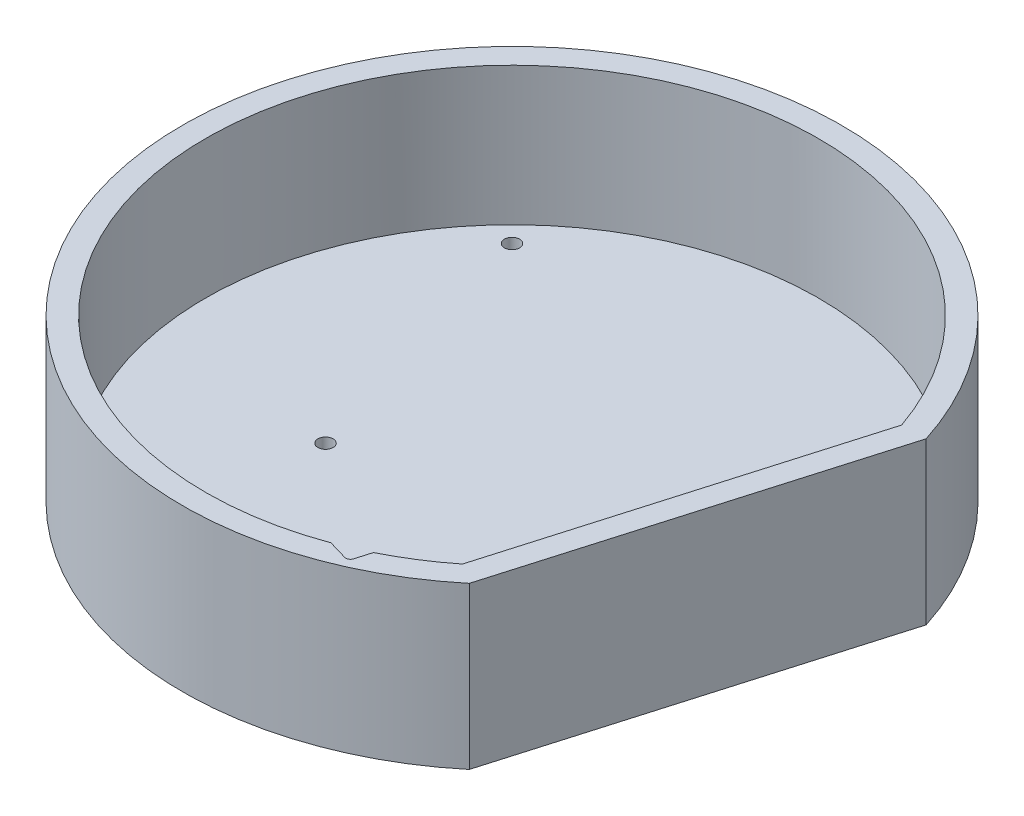
ISO-10303-21;
HEADER;
FILE_DESCRIPTION(('STEP AP214'),'2;1');
FILE_NAME('part.step','',(''),(''),'','','');
FILE_SCHEMA(('AUTOMOTIVE_DESIGN { 1 0 10303 214 1 1 1 1 }'));
ENDSEC;
DATA;
#1=APPLICATION_CONTEXT('core data for automotive mechanical design processes');
#2=APPLICATION_PROTOCOL_DEFINITION('international standard','automotive_design',2000,#1);
#3=PRODUCT_CONTEXT('',#1,'mechanical');
#4=PRODUCT('Part','Part','',(#3));
#5=PRODUCT_RELATED_PRODUCT_CATEGORY('part','',(#4));
#6=PRODUCT_DEFINITION_FORMATION('','',#4);
#7=PRODUCT_DEFINITION_CONTEXT('part definition',#1,'design');
#8=PRODUCT_DEFINITION('design','',#6,#7);
#9=PRODUCT_DEFINITION_SHAPE('','',#8);
#10=(LENGTH_UNIT() NAMED_UNIT(*) SI_UNIT(.MILLI.,.METRE.));
#11=(NAMED_UNIT(*) PLANE_ANGLE_UNIT() SI_UNIT($,.RADIAN.));
#12=(NAMED_UNIT(*) SI_UNIT($,.STERADIAN.) SOLID_ANGLE_UNIT());
#13=UNCERTAINTY_MEASURE_WITH_UNIT(LENGTH_MEASURE(1.E-05),#10,'distance_accuracy_value','');
#14=(GEOMETRIC_REPRESENTATION_CONTEXT(3) GLOBAL_UNCERTAINTY_ASSIGNED_CONTEXT((#13)) GLOBAL_UNIT_ASSIGNED_CONTEXT((#10,
#11,#12)) REPRESENTATION_CONTEXT('',''));
#15=CARTESIAN_POINT('',(0.,0.,0.));
#16=DIRECTION('',(0.,0.,1.));
#17=DIRECTION('',(1.,0.,0.));
#18=AXIS2_PLACEMENT_3D('',#15,#16,#17);
#19=CARTESIAN_POINT('',(0.,5.,0.));
#20=DIRECTION('',(0.,1.,0.));
#21=DIRECTION('',(0.,0.,1.));
#22=AXIS2_PLACEMENT_3D('',#19,#20,#21);
#23=PLANE('',#22);
#24=CARTESIAN_POINT('',(26.5691382315799,5.,29.6733976692491));
#25=DIRECTION('',(0.,1.,0.));
#26=DIRECTION('',(0.,0.,1.));
#27=AXIS2_PLACEMENT_3D('',#24,#25,#26);
#28=CIRCLE('',#27,1.65);
#29=CARTESIAN_POINT('',(26.5691382315799,5.,31.3233976692491));
#30=VERTEX_POINT('',#29);
#31=EDGE_CURVE('E261',#30,#30,#28,.T.);
#32=ORIENTED_EDGE('',*,*,#31,.F.);
#33=EDGE_LOOP('',(#32));
#34=FACE_BOUND('',#33,.T.);
#35=CARTESIAN_POINT('',(-26.2282282114271,5.,14.264371201531));
#36=DIRECTION('',(0.,1.,0.));
#37=DIRECTION('',(0.,0.,1.));
#38=AXIS2_PLACEMENT_3D('',#35,#36,#37);
#39=CIRCLE('',#38,1.65);
#40=CARTESIAN_POINT('',(-26.2282282114271,5.,15.914371201531));
#41=VERTEX_POINT('',#40);
#42=EDGE_CURVE('E265',#41,#41,#39,.T.);
#43=ORIENTED_EDGE('',*,*,#42,.F.);
#44=EDGE_LOOP('',(#43));
#45=FACE_BOUND('',#44,.T.);
#46=CARTESIAN_POINT('',(-43.5224223820315,5.,-43.5224223820325));
#47=DIRECTION('',(0.,1.,0.));
#48=DIRECTION('',(0.,0.,1.));
#49=AXIS2_PLACEMENT_3D('',#46,#47,#48);
#50=CIRCLE('',#49,1.65);
#51=CARTESIAN_POINT('',(-43.5224223820315,5.,-41.8724223820325));
#52=VERTEX_POINT('',#51);
#53=EDGE_CURVE('E177',#52,#52,#50,.T.);
#54=ORIENTED_EDGE('',*,*,#53,.F.);
#55=EDGE_LOOP('',(#54));
#56=FACE_BOUND('',#55,.T.);
#57=CARTESIAN_POINT('',(-43.5224223820323,5.,43.5224223820317));
#58=DIRECTION('',(0.,1.,0.));
#59=DIRECTION('',(0.,0.,1.));
#60=AXIS2_PLACEMENT_3D('',#57,#58,#59);
#61=CIRCLE('',#60,1.65);
#62=CARTESIAN_POINT('',(-43.5224223820323,5.,45.1724223820317));
#63=VERTEX_POINT('',#62);
#64=EDGE_CURVE('E171',#63,#63,#61,.T.);
#65=ORIENTED_EDGE('',*,*,#64,.F.);
#66=EDGE_LOOP('',(#65));
#67=FACE_BOUND('',#66,.T.);
#68=CARTESIAN_POINT('',(3.22127810675323,5.,61.465647864144));
#69=DIRECTION('',(0.,1.,0.));
#70=DIRECTION('',(0.,0.,1.));
#71=AXIS2_PLACEMENT_3D('',#68,#69,#70);
#72=CIRCLE('',#71,1.65);
#73=CARTESIAN_POINT('',(3.22127810675323,5.,63.115647864144));
#74=VERTEX_POINT('',#73);
#75=EDGE_CURVE('E165',#74,#74,#72,.T.);
#76=ORIENTED_EDGE('',*,*,#75,.F.);
#77=EDGE_LOOP('',(#76));
#78=FACE_BOUND('',#77,.T.);
#79=CARTESIAN_POINT('',(43.522422382032,5.,-43.522422382032));
#80=DIRECTION('',(0.,1.,0.));
#81=DIRECTION('',(0.,0.,1.));
#82=AXIS2_PLACEMENT_3D('',#79,#80,#81);
#83=CIRCLE('',#82,1.65);
#84=CARTESIAN_POINT('',(43.522422382032,5.,-41.872422382032));
#85=VERTEX_POINT('',#84);
#86=EDGE_CURVE('E162',#85,#85,#83,.T.);
#87=ORIENTED_EDGE('',*,*,#86,.F.);
#88=EDGE_LOOP('',(#87));
#89=FACE_BOUND('',#88,.T.);
#90=DIRECTION('',(0.280164117594875,0.,-0.959952117145582));
#91=VECTOR('',#90,1.);
#92=CARTESIAN_POINT('',(41.3733009869135,5.,52.1199289182772));
#93=LINE('',#92,#91);
#94=CARTESIAN_POINT('',(41.3733009869135,5.,52.1199289182772));
#95=VERTEX_POINT('',#94);
#96=CARTESIAN_POINT('',(62.9130589601029,5.,-21.6837274766729));
#97=VERTEX_POINT('',#96);
#98=EDGE_CURVE('E140',#95,#97,#93,.T.);
#99=ORIENTED_EDGE('',*,*,#98,.T.);
#100=CARTESIAN_POINT('',(0.,5.,0.));
#101=DIRECTION('',(0.,1.,0.));
#102=DIRECTION('',(0.,0.,1.));
#103=AXIS2_PLACEMENT_3D('',#100,#101,#102);
#104=CIRCLE('',#103,66.545);
#105=EDGE_CURVE('E118',#97,#95,#104,.T.);
#106=ORIENTED_EDGE('',*,*,#105,.T.);
#107=EDGE_LOOP('',(#99,#106));
#108=FACE_BOUND('',#107,.T.);
#109=ADVANCED_FACE('F39',(#34,#45,#56,#67,#78,#89,#108),#23,.T.);
#110=CARTESIAN_POINT('',(0.,5.,0.));
#111=DIRECTION('',(0.,-1.,0.));
#112=DIRECTION('',(0.,0.,-1.));
#113=AXIS2_PLACEMENT_3D('',#110,#111,#112);
#114=CYLINDRICAL_SURFACE('',#113,71.545);
#115=CARTESIAN_POINT('',(0.,0.,0.));
#116=DIRECTION('',(0.,1.,0.));
#117=DIRECTION('',(0.,0.,1.));
#118=AXIS2_PLACEMENT_3D('',#115,#116,#117);
#119=CIRCLE('',#118,71.545);
#120=CARTESIAN_POINT('',(68.1495052630311,0.,-21.7791633770468));
#121=VERTEX_POINT('',#120);
#122=CARTESIAN_POINT('',(45.7363758554411,0.,55.0170059945998));
#123=VERTEX_POINT('',#122);
#124=EDGE_CURVE('E161',#121,#123,#119,.T.);
#125=ORIENTED_EDGE('',*,*,#124,.T.);
#126=DIRECTION('',(0.,-1.,0.));
#127=VECTOR('',#126,1.);
#128=CARTESIAN_POINT('',(45.7363758554411,5.,55.0170059945998));
#129=LINE('',#128,#127);
#130=CARTESIAN_POINT('',(45.7363758554411,35.,55.0170059945998));
#131=VERTEX_POINT('',#130);
#132=EDGE_CURVE('E129',#131,#123,#129,.T.);
#133=ORIENTED_EDGE('',*,*,#132,.F.);
#134=CARTESIAN_POINT('',(0.,35.,0.));
#135=DIRECTION('',(0.,1.,0.));
#136=DIRECTION('',(0.,0.,1.));
#137=AXIS2_PLACEMENT_3D('',#134,#135,#136);
#138=CIRCLE('',#137,71.545);
#139=CARTESIAN_POINT('',(68.1495052630311,35.,-21.7791633770468));
#140=VERTEX_POINT('',#139);
#141=EDGE_CURVE('E151',#140,#131,#138,.T.);
#142=ORIENTED_EDGE('',*,*,#141,.F.);
#143=DIRECTION('',(0.,-1.,0.));
#144=VECTOR('',#143,1.);
#145=CARTESIAN_POINT('',(68.1495052630311,5.,-21.7791633770468));
#146=LINE('',#145,#144);
#147=EDGE_CURVE('E186',#140,#121,#146,.T.);
#148=ORIENTED_EDGE('',*,*,#147,.T.);
#149=EDGE_LOOP('',(#125,#133,#142,#148));
#150=FACE_BOUND('',#149,.T.);
#151=ADVANCED_FACE('F218',(#150),#114,.T.);
#152=CARTESIAN_POINT('',(45.7363758554411,5.,55.0170059945998));
#153=DIRECTION('',(-0.959952117145582,0.,-0.280164117594875));
#154=DIRECTION('',(-0.280164117594875,0.,0.959952117145582));
#155=AXIS2_PLACEMENT_3D('',#152,#153,#154);
#156=PLANE('',#155);
#157=DIRECTION('',(0.280164117594875,0.,-0.959952117145582));
#158=VECTOR('',#157,1.);
#159=CARTESIAN_POINT('',(45.7363758554411,0.,55.0170059945998));
#160=LINE('',#159,#158);
#161=EDGE_CURVE('E184',#123,#121,#160,.T.);
#162=ORIENTED_EDGE('',*,*,#161,.T.);
#163=ORIENTED_EDGE('',*,*,#147,.F.);
#164=DIRECTION('',(0.280164117594875,0.,-0.959952117145582));
#165=VECTOR('',#164,1.);
#166=CARTESIAN_POINT('',(45.7363758554411,35.,55.0170059945998));
#167=LINE('',#166,#165);
#168=EDGE_CURVE('E154',#131,#140,#167,.T.);
#169=ORIENTED_EDGE('',*,*,#168,.F.);
#170=ORIENTED_EDGE('',*,*,#132,.T.);
#171=EDGE_LOOP('',(#162,#163,#169,#170));
#172=FACE_BOUND('',#171,.T.);
#173=ADVANCED_FACE('F226',(#172),#156,.F.);
#174=CARTESIAN_POINT('',(0.,0.,0.));
#175=DIRECTION('',(0.,1.,0.));
#176=DIRECTION('',(0.,0.,1.));
#177=AXIS2_PLACEMENT_3D('',#174,#175,#176);
#178=PLANE('',#177);
#179=CARTESIAN_POINT('',(26.5691382315799,0.,29.6733976692491));
#180=DIRECTION('',(0.,1.,0.));
#181=DIRECTION('',(0.,0.,1.));
#182=AXIS2_PLACEMENT_3D('',#179,#180,#181);
#183=CIRCLE('',#182,1.65);
#184=CARTESIAN_POINT('',(26.5691382315799,0.,31.3233976692491));
#185=VERTEX_POINT('',#184);
#186=EDGE_CURVE('E259',#185,#185,#183,.T.);
#187=ORIENTED_EDGE('',*,*,#186,.T.);
#188=EDGE_LOOP('',(#187));
#189=FACE_BOUND('',#188,.T.);
#190=CARTESIAN_POINT('',(-26.2282282114271,0.,14.264371201531));
#191=DIRECTION('',(0.,1.,0.));
#192=DIRECTION('',(0.,0.,1.));
#193=AXIS2_PLACEMENT_3D('',#190,#191,#192);
#194=CIRCLE('',#193,1.65);
#195=CARTESIAN_POINT('',(-26.2282282114271,0.,15.914371201531));
#196=VERTEX_POINT('',#195);
#197=EDGE_CURVE('E270',#196,#196,#194,.T.);
#198=ORIENTED_EDGE('',*,*,#197,.T.);
#199=EDGE_LOOP('',(#198));
#200=FACE_BOUND('',#199,.T.);
#201=CARTESIAN_POINT('',(43.522422382032,0.,-43.522422382032));
#202=DIRECTION('',(0.,1.,0.));
#203=DIRECTION('',(0.,0.,1.));
#204=AXIS2_PLACEMENT_3D('',#201,#202,#203);
#205=CIRCLE('',#204,1.65);
#206=CARTESIAN_POINT('',(43.522422382032,0.,-41.872422382032));
#207=VERTEX_POINT('',#206);
#208=EDGE_CURVE('E158',#207,#207,#205,.T.);
#209=ORIENTED_EDGE('',*,*,#208,.T.);
#210=EDGE_LOOP('',(#209));
#211=FACE_BOUND('',#210,.T.);
#212=CARTESIAN_POINT('',(3.22127810675323,0.,61.465647864144));
#213=DIRECTION('',(0.,1.,0.));
#214=DIRECTION('',(0.,0.,1.));
#215=AXIS2_PLACEMENT_3D('',#212,#213,#214);
#216=CIRCLE('',#215,1.65);
#217=CARTESIAN_POINT('',(3.22127810675323,0.,63.115647864144));
#218=VERTEX_POINT('',#217);
#219=EDGE_CURVE('E168',#218,#218,#216,.T.);
#220=ORIENTED_EDGE('',*,*,#219,.T.);
#221=EDGE_LOOP('',(#220));
#222=FACE_BOUND('',#221,.T.);
#223=CARTESIAN_POINT('',(-43.5224223820323,0.,43.5224223820317));
#224=DIRECTION('',(0.,1.,0.));
#225=DIRECTION('',(0.,0.,1.));
#226=AXIS2_PLACEMENT_3D('',#223,#224,#225);
#227=CIRCLE('',#226,1.65);
#228=CARTESIAN_POINT('',(-43.5224223820323,0.,45.1724223820317));
#229=VERTEX_POINT('',#228);
#230=EDGE_CURVE('E174',#229,#229,#227,.T.);
#231=ORIENTED_EDGE('',*,*,#230,.T.);
#232=EDGE_LOOP('',(#231));
#233=FACE_BOUND('',#232,.T.);
#234=CARTESIAN_POINT('',(-43.5224223820315,0.,-43.5224223820325));
#235=DIRECTION('',(0.,1.,0.));
#236=DIRECTION('',(0.,0.,1.));
#237=AXIS2_PLACEMENT_3D('',#234,#235,#236);
#238=CIRCLE('',#237,1.65);
#239=CARTESIAN_POINT('',(-43.5224223820315,0.,-41.8724223820325));
#240=VERTEX_POINT('',#239);
#241=EDGE_CURVE('E157',#240,#240,#238,.T.);
#242=ORIENTED_EDGE('',*,*,#241,.T.);
#243=EDGE_LOOP('',(#242));
#244=FACE_BOUND('',#243,.T.);
#245=ORIENTED_EDGE('',*,*,#124,.F.);
#246=ORIENTED_EDGE('',*,*,#161,.F.);
#247=EDGE_LOOP('',(#245,#246));
#248=FACE_BOUND('',#247,.T.);
#249=ADVANCED_FACE('F235',(#189,#200,#211,#222,#233,#244,#248),#178,.F.);
#250=CARTESIAN_POINT('',(-43.5224223820315,0.,-43.5224223820325));
#251=DIRECTION('',(0.,1.,0.));
#252=DIRECTION('',(0.,0.,1.));
#253=AXIS2_PLACEMENT_3D('',#250,#251,#252);
#254=CYLINDRICAL_SURFACE('',#253,1.65);
#255=ORIENTED_EDGE('',*,*,#241,.F.);
#256=EDGE_LOOP('',(#255));
#257=FACE_BOUND('',#256,.T.);
#258=ORIENTED_EDGE('',*,*,#53,.T.);
#259=EDGE_LOOP('',(#258));
#260=FACE_BOUND('',#259,.T.);
#261=ADVANCED_FACE('F233',(#257,#260),#254,.F.);
#262=CARTESIAN_POINT('',(-43.5224223820323,0.,43.5224223820317));
#263=DIRECTION('',(0.,1.,0.));
#264=DIRECTION('',(0.,0.,1.));
#265=AXIS2_PLACEMENT_3D('',#262,#263,#264);
#266=CYLINDRICAL_SURFACE('',#265,1.65);
#267=ORIENTED_EDGE('',*,*,#230,.F.);
#268=EDGE_LOOP('',(#267));
#269=FACE_BOUND('',#268,.T.);
#270=ORIENTED_EDGE('',*,*,#64,.T.);
#271=EDGE_LOOP('',(#270));
#272=FACE_BOUND('',#271,.T.);
#273=ADVANCED_FACE('F332',(#269,#272),#266,.F.);
#274=CARTESIAN_POINT('',(3.22127810675323,0.,61.465647864144));
#275=DIRECTION('',(0.,1.,0.));
#276=DIRECTION('',(0.,0.,1.));
#277=AXIS2_PLACEMENT_3D('',#274,#275,#276);
#278=CYLINDRICAL_SURFACE('',#277,1.65);
#279=ORIENTED_EDGE('',*,*,#219,.F.);
#280=EDGE_LOOP('',(#279));
#281=FACE_BOUND('',#280,.T.);
#282=ORIENTED_EDGE('',*,*,#75,.T.);
#283=EDGE_LOOP('',(#282));
#284=FACE_BOUND('',#283,.T.);
#285=ADVANCED_FACE('F341',(#281,#284),#278,.F.);
#286=CARTESIAN_POINT('',(43.522422382032,0.,-43.522422382032));
#287=DIRECTION('',(0.,1.,0.));
#288=DIRECTION('',(0.,0.,1.));
#289=AXIS2_PLACEMENT_3D('',#286,#287,#288);
#290=CYLINDRICAL_SURFACE('',#289,1.65);
#291=ORIENTED_EDGE('',*,*,#208,.F.);
#292=EDGE_LOOP('',(#291));
#293=FACE_BOUND('',#292,.T.);
#294=ORIENTED_EDGE('',*,*,#86,.T.);
#295=EDGE_LOOP('',(#294));
#296=FACE_BOUND('',#295,.T.);
#297=ADVANCED_FACE('F350',(#293,#296),#290,.F.);
#298=CARTESIAN_POINT('',(0.,35.,0.));
#299=DIRECTION('',(0.,1.,0.));
#300=DIRECTION('',(0.,0.,1.));
#301=AXIS2_PLACEMENT_3D('',#298,#299,#300);
#302=PLANE('',#301);
#303=DIRECTION('',(0.280164117594875,0.,-0.959952117145582));
#304=VECTOR('',#303,1.);
#305=CARTESIAN_POINT('',(28.2912821393938,35.,63.9276925877083));
#306=LINE('',#305,#304);
#307=CARTESIAN_POINT('',(28.5714462569886,35.,62.9677404705627));
#308=VERTEX_POINT('',#307);
#309=CARTESIAN_POINT('',(29.5468341277726,35.,59.6256791829317));
#310=VERTEX_POINT('',#309);
#311=EDGE_CURVE('E255',#308,#310,#306,.T.);
#312=ORIENTED_EDGE('',*,*,#311,.F.);
#313=CARTESIAN_POINT('',(27.6114941398431,35.,62.6875763529678));
#314=DIRECTION('',(0.,1.,0.));
#315=DIRECTION('',(0.,0.,1.));
#316=AXIS2_PLACEMENT_3D('',#313,#314,#315);
#317=CIRCLE('',#316,1.);
#318=CARTESIAN_POINT('',(27.3313300222482,35.,63.6475284701134));
#319=VERTEX_POINT('',#318);
#320=EDGE_CURVE('E11',#308,#319,#317,.F.);
#321=ORIENTED_EDGE('',*,*,#320,.T.);
#322=DIRECTION('',(-0.959952117145582,0.,-0.280164117594875));
#323=VECTOR('',#322,1.);
#324=CARTESIAN_POINT('',(-14.9723407505178,35.,51.3011099546588));
#325=LINE('',#324,#323);
#326=CARTESIAN_POINT('',(23.0914512240824,35.,62.4101106020958));
#327=VERTEX_POINT('',#326);
#328=EDGE_CURVE('E108',#319,#327,#325,.T.);
#329=ORIENTED_EDGE('',*,*,#328,.T.);
#330=CARTESIAN_POINT('',(0.,35.,0.));
#331=DIRECTION('',(0.,1.,0.));
#332=DIRECTION('',(0.,0.,1.));
#333=AXIS2_PLACEMENT_3D('',#330,#331,#332);
#334=CIRCLE('',#333,66.545);
#335=CARTESIAN_POINT('',(62.9130589601029,35.,-21.6837274766729));
#336=VERTEX_POINT('',#335);
#337=EDGE_CURVE('E114',#336,#327,#334,.T.);
#338=ORIENTED_EDGE('',*,*,#337,.F.);
#339=DIRECTION('',(0.280164117594875,0.,-0.959952117145582));
#340=VECTOR('',#339,1.);
#341=CARTESIAN_POINT('',(41.3733009869135,35.,52.1199289182772));
#342=LINE('',#341,#340);
#343=CARTESIAN_POINT('',(41.3733009869135,35.,52.1199289182772));
#344=VERTEX_POINT('',#343);
#345=EDGE_CURVE('E136',#344,#336,#342,.T.);
#346=ORIENTED_EDGE('',*,*,#345,.F.);
#347=EDGE_CURVE('E137',#310,#344,#334,.T.);
#348=ORIENTED_EDGE('',*,*,#347,.F.);
#349=EDGE_LOOP('',(#312,#321,#329,#338,#346,#348));
#350=FACE_BOUND('',#349,.T.);
#351=ORIENTED_EDGE('',*,*,#141,.T.);
#352=ORIENTED_EDGE('',*,*,#168,.T.);
#353=EDGE_LOOP('',(#351,#352));
#354=FACE_BOUND('',#353,.T.);
#355=ADVANCED_FACE('F110',(#350,#354),#302,.T.);
#356=CARTESIAN_POINT('',(0.,35.,0.));
#357=DIRECTION('',(0.,-1.,0.));
#358=DIRECTION('',(0.,0.,-1.));
#359=AXIS2_PLACEMENT_3D('',#356,#357,#358);
#360=CYLINDRICAL_SURFACE('',#359,66.545);
#361=DIRECTION('',(0.,-1.,0.));
#362=VECTOR('',#361,1.);
#363=CARTESIAN_POINT('',(29.5468341277726,35.,59.6256791829317));
#364=LINE('',#363,#362);
#365=CARTESIAN_POINT('',(29.5468341277726,19.,59.6256791829317));
#366=VERTEX_POINT('',#365);
#367=EDGE_CURVE('E198',#310,#366,#364,.T.);
#368=ORIENTED_EDGE('',*,*,#367,.F.);
#369=ORIENTED_EDGE('',*,*,#347,.T.);
#370=DIRECTION('',(0.,-1.,0.));
#371=VECTOR('',#370,1.);
#372=CARTESIAN_POINT('',(41.3733009869135,35.,52.1199289182772));
#373=LINE('',#372,#371);
#374=EDGE_CURVE('E148',#344,#95,#373,.T.);
#375=ORIENTED_EDGE('',*,*,#374,.T.);
#376=ORIENTED_EDGE('',*,*,#105,.F.);
#377=DIRECTION('',(0.,-1.,0.));
#378=VECTOR('',#377,1.);
#379=CARTESIAN_POINT('',(62.9130589601029,35.,-21.6837274766729));
#380=LINE('',#379,#378);
#381=EDGE_CURVE('E135',#336,#97,#380,.T.);
#382=ORIENTED_EDGE('',*,*,#381,.F.);
#383=ORIENTED_EDGE('',*,*,#337,.T.);
#384=DIRECTION('',(0.,-1.,0.));
#385=VECTOR('',#384,1.);
#386=CARTESIAN_POINT('',(23.0914512240824,35.,62.4101106020958));
#387=LINE('',#386,#385);
#388=CARTESIAN_POINT('',(23.0914512240824,17.3949989514268,62.4101106020958));
#389=VERTEX_POINT('',#388);
#390=EDGE_CURVE('E123',#327,#389,#387,.T.);
#391=ORIENTED_EDGE('',*,*,#390,.T.);
#392=CARTESIAN_POINT('',(23.0914512240824,17.3949989514268,62.4101106020958));
#393=CARTESIAN_POINT('',(23.0914688030825,17.3525429388355,62.410103874751));
#394=CARTESIAN_POINT('',(23.0932027413458,17.3101229819456,62.4094625752827));
#395=CARTESIAN_POINT('',(23.0998490199431,17.2256010583835,62.4070029610719));
#396=CARTESIAN_POINT('',(23.1047585861938,17.1834988465875,62.405185673618));
#397=CARTESIAN_POINT('',(23.1238336684952,17.0581958554614,62.3981212115181));
#398=CARTESIAN_POINT('',(23.142348997143,16.9757223736181,62.3912601922225));
#399=CARTESIAN_POINT('',(23.192255754793,16.8056414495918,62.3727270370539));
#400=CARTESIAN_POINT('',(23.2248125771744,16.7184283969405,62.3606188012845));
#401=CARTESIAN_POINT('',(23.3013816682862,16.549826162319,62.3320487819596));
#402=CARTESIAN_POINT('',(23.3454100392659,16.4684453732981,62.31558087835));
#403=CARTESIAN_POINT('',(23.4513874179626,16.3011558453538,62.2757828364161));
#404=CARTESIAN_POINT('',(23.515053449382,16.2164865605364,62.2517858825182));
#405=CARTESIAN_POINT('',(23.6543546248918,16.0593320907574,62.1989876864473));
#406=CARTESIAN_POINT('',(23.7299940585999,15.9868512917362,62.1701847222617));
#407=CARTESIAN_POINT('',(23.8936428365759,15.8542351523288,62.1074774503329));
#408=CARTESIAN_POINT('',(23.9819518595129,15.7945283241394,62.0734474642171));
#409=CARTESIAN_POINT('',(24.1666445866116,15.6924216503749,62.0017747215886));
#410=CARTESIAN_POINT('',(24.2630154349581,15.6499948601743,61.964137703589));
#411=CARTESIAN_POINT('',(24.4061821896428,15.6024249982529,61.9078151524176));
#412=CARTESIAN_POINT('',(24.450945558819,15.5896345395761,61.8901498033481));
#413=CARTESIAN_POINT('',(24.5411905294607,15.5680210002681,61.8544205886825));
#414=CARTESIAN_POINT('',(24.5866710926989,15.5591926478189,61.8363572863816));
#415=CARTESIAN_POINT('',(24.6324208811549,15.5523977293929,61.8181273295596));
#416=B_SPLINE_CURVE_WITH_KNOTS('',3,(#392,#393,#394,#395,#396,#397,#398,#399,#400,#401,#402,
#403,#404,#405,#406,#407,#408,#409,#410,#411,#412,#413,#414,#415),.UNSPECIFIED.,.F.,.F.,(4,2,2,
2,2,2,2,2,2,2,2,4),(0.,0.127270515160103,0.254430002502292,0.507928602625905,0.788541106541654,
1.06954963946453,1.39392547435498,1.71841778497217,2.05250691094153,2.38607308140368,
2.53531529433342,2.6843583385834),.UNSPECIFIED.);
#417=CARTESIAN_POINT('',(24.6324208811549,15.5523977293928,61.8181273295596));
#418=VERTEX_POINT('',#417);
#419=EDGE_CURVE('E48',#389,#418,#416,.T.);
#420=ORIENTED_EDGE('',*,*,#419,.T.);
#421=CARTESIAN_POINT('',(29.5468341277725,19.,59.6256791829317));
#422=CARTESIAN_POINT('',(29.5468580963109,18.9192083567755,59.6256658259351));
#423=CARTESIAN_POINT('',(29.543428119815,18.8384315504481,59.6273669609418));
#424=CARTESIAN_POINT('',(29.529845024836,18.6776430925106,59.6340958005609));
#425=CARTESIAN_POINT('',(29.5196968920723,18.5976309180832,59.6391210382676));
#426=CARTESIAN_POINT('',(29.4929702288368,18.4396268392226,59.652342275389));
#427=CARTESIAN_POINT('',(29.4764443592543,18.3616238302247,59.6605123068786));
#428=CARTESIAN_POINT('',(29.4372933384313,18.2075567557179,59.6798396722614));
#429=CARTESIAN_POINT('',(29.4146673592039,18.131492954959,59.6909974116841));
#430=CARTESIAN_POINT('',(29.3383463485426,17.9073894175079,59.7285666748545));
#431=CARTESIAN_POINT('',(29.2761068060446,17.7628615778836,59.759124755352));
#432=CARTESIAN_POINT('',(29.1323886809599,17.4859903140735,59.8293184777239));
#433=CARTESIAN_POINT('',(29.050868169582,17.3536743303219,59.86897389713));
#434=CARTESIAN_POINT('',(28.8379611870053,17.0546480810527,59.9718910049641));
#435=CARTESIAN_POINT('',(28.6994254748487,16.8941274294319,60.0383815868068));
#436=CARTESIAN_POINT('',(28.4002871544948,16.5999818699645,60.1804643489371));
#437=CARTESIAN_POINT('',(28.2396452248066,16.4664059581512,60.2560727171899));
#438=CARTESIAN_POINT('',(27.8515807139226,16.1896149697515,60.4366174719278));
#439=CARTESIAN_POINT('',(27.6185802981256,16.0555266104409,60.5435482761023));
#440=CARTESIAN_POINT('',(27.1347513119698,15.8306469536444,60.7619370816812));
#441=CARTESIAN_POINT('',(26.8839125952444,15.7398805275484,60.8733976439008));
#442=CARTESIAN_POINT('',(26.367530864339,15.5997808745989,61.0988610249506));
#443=CARTESIAN_POINT('',(26.1018288102776,15.5510590684927,61.2128774001186));
#444=CARTESIAN_POINT('',(25.5650779057707,15.497532939674,61.4389829624094));
#445=CARTESIAN_POINT('',(25.2940269054495,15.4927466514922,61.5510713392916));
#446=CARTESIAN_POINT('',(24.7578674787712,15.5281009038702,61.7686594156516));
#447=CARTESIAN_POINT('',(24.4927397372445,15.5674363052707,61.8742412807551));
#448=CARTESIAN_POINT('',(23.9709383346814,15.69175483353,62.0782496590846));
#449=CARTESIAN_POINT('',(23.7142423384156,15.7766049319061,62.1766960804174));
#450=CARTESIAN_POINT('',(23.4026270195343,15.913015455304,62.2941314100993));
#451=CARTESIAN_POINT('',(23.3394379061374,15.9424989097264,62.3178317586925));
#452=CARTESIAN_POINT('',(23.2144073823036,16.0046248107556,62.3645149825326));
#453=CARTESIAN_POINT('',(23.1525652894205,16.0372656098812,62.3874982237691));
#454=CARTESIAN_POINT('',(23.0914512240824,16.0715143220564,62.4101106020958));
#455=B_SPLINE_CURVE_WITH_KNOTS('',3,(#421,#422,#423,#424,#425,#426,#427,#428,#429,#430,#431,
#432,#433,#434,#435,#436,#437,#438,#439,#440,#441,#442,#443,#444,#445,#446,#447,#448,#449,#450,
#451,#452,#453,#454),.UNSPECIFIED.,.F.,.F.,(4,2,2,2,2,2,2,2,2,2,2,2,2,2,2,2,4),(0.,
0.242260072694742,0.484340559097534,0.724463539589502,0.96461912914606,1.44319262449105,
1.92281656265992,2.58580167670855,3.24998169890322,4.11338402276651,4.97728143678407,
5.85353974875002,6.73015772874518,7.59103562231783,8.44941097884802,8.67029300804026,
8.89106039790733),.UNSPECIFIED.);
#456=EDGE_CURVE('E128',#366,#418,#455,.T.);
#457=ORIENTED_EDGE('',*,*,#456,.F.);
#458=EDGE_LOOP('',(#368,#369,#375,#376,#382,#383,#391,#420,#457));
#459=FACE_BOUND('',#458,.T.);
#460=ADVANCED_FACE('F133',(#459),#360,.F.);
#461=CARTESIAN_POINT('',(41.3733009869135,35.,52.1199289182772));
#462=DIRECTION('',(-0.959952117145582,0.,-0.280164117594875));
#463=DIRECTION('',(-0.280164117594875,0.,0.959952117145582));
#464=AXIS2_PLACEMENT_3D('',#461,#462,#463);
#465=PLANE('',#464);
#466=ORIENTED_EDGE('',*,*,#98,.F.);
#467=ORIENTED_EDGE('',*,*,#374,.F.);
#468=ORIENTED_EDGE('',*,*,#345,.T.);
#469=ORIENTED_EDGE('',*,*,#381,.T.);
#470=EDGE_LOOP('',(#466,#467,#468,#469));
#471=FACE_BOUND('',#470,.T.);
#472=ADVANCED_FACE('F208',(#471),#465,.T.);
#473=CARTESIAN_POINT('',(24.9314497293842,19.,62.9471181761262));
#474=DIRECTION('',(0.280164117594875,0.,-0.959952117145582));
#475=DIRECTION('',(-0.959952117145582,0.,-0.280164117594875));
#476=AXIS2_PLACEMENT_3D('',#473,#474,#475);
#477=CYLINDRICAL_SURFACE('',#476,3.5);
#478=ORIENTED_EDGE('',*,*,#456,.T.);
#479=CARTESIAN_POINT('',(25.2116138469791,19.,61.9871660589806));
#480=DIRECTION('',(0.280164117594875,0.,-0.959952117145582));
#481=DIRECTION('',(-0.959952117145582,0.,-0.280164117594875));
#482=AXIS2_PLACEMENT_3D('',#479,#480,#481);
#483=CIRCLE('',#482,3.5);
#484=CARTESIAN_POINT('',(28.5714462569886,19.,62.9677404705627));
#485=VERTEX_POINT('',#484);
#486=EDGE_CURVE('E63',#418,#485,#483,.F.);
#487=ORIENTED_EDGE('',*,*,#486,.T.);
#488=DIRECTION('',(0.280164117594875,0.,-0.959952117145582));
#489=VECTOR('',#488,1.);
#490=CARTESIAN_POINT('',(28.2912821393938,19.,63.9276925877083));
#491=LINE('',#490,#489);
#492=EDGE_CURVE('E119',#485,#366,#491,.T.);
#493=ORIENTED_EDGE('',*,*,#492,.T.);
#494=EDGE_LOOP('',(#478,#487,#493));
#495=FACE_BOUND('',#494,.T.);
#496=ADVANCED_FACE('F203',(#495),#477,.F.);
#497=CARTESIAN_POINT('',(28.2912821393938,19.,63.9276925877083));
#498=DIRECTION('',(0.959952117145582,0.,0.280164117594875));
#499=DIRECTION('',(0.280164117594875,0.,-0.959952117145582));
#500=AXIS2_PLACEMENT_3D('',#497,#498,#499);
#501=PLANE('',#500);
#502=ORIENTED_EDGE('',*,*,#492,.F.);
#503=DIRECTION('',(0.,-1.,0.));
#504=VECTOR('',#503,1.);
#505=CARTESIAN_POINT('',(28.5714462569886,19.,62.9677404705627));
#506=LINE('',#505,#504);
#507=EDGE_CURVE('E55',#485,#308,#506,.F.);
#508=ORIENTED_EDGE('',*,*,#507,.T.);
#509=ORIENTED_EDGE('',*,*,#311,.T.);
#510=ORIENTED_EDGE('',*,*,#367,.T.);
#511=EDGE_LOOP('',(#502,#508,#509,#510));
#512=FACE_BOUND('',#511,.T.);
#513=ADVANCED_FACE('F207',(#512),#501,.F.);
#514=CARTESIAN_POINT('',(24.9314497293842,19.,62.9471181761262));
#515=DIRECTION('',(0.280164117594875,0.,-0.959952117145582));
#516=DIRECTION('',(-0.959952117145582,0.,-0.280164117594875));
#517=AXIS2_PLACEMENT_3D('',#514,#515,#516);
#518=PLANE('',#517);
#519=DIRECTION('',(0.,-1.,0.));
#520=VECTOR('',#519,1.);
#521=CARTESIAN_POINT('',(27.3313300222482,19.,63.6475284701134));
#522=LINE('',#521,#520);
#523=CARTESIAN_POINT('',(27.3313300222482,19.,63.6475284701134));
#524=VERTEX_POINT('',#523);
#525=EDGE_CURVE('E251',#319,#524,#522,.T.);
#526=ORIENTED_EDGE('',*,*,#525,.T.);
#527=CARTESIAN_POINT('',(24.9314497293842,19.,62.9471181761262));
#528=DIRECTION('',(0.280164117594875,0.,-0.959952117145582));
#529=DIRECTION('',(-0.959952117145582,0.,-0.280164117594875));
#530=AXIS2_PLACEMENT_3D('',#527,#528,#529);
#531=CIRCLE('',#530,2.5);
#532=EDGE_CURVE('E126',#524,#389,#531,.T.);
#533=ORIENTED_EDGE('',*,*,#532,.T.);
#534=ORIENTED_EDGE('',*,*,#390,.F.);
#535=ORIENTED_EDGE('',*,*,#328,.F.);
#536=EDGE_LOOP('',(#526,#533,#534,#535));
#537=FACE_BOUND('',#536,.T.);
#538=ADVANCED_FACE('F124',(#537),#518,.T.);
#539=CARTESIAN_POINT('',(27.6114941398431,19.,62.6875763529678));
#540=DIRECTION('',(0.,-1.,0.));
#541=DIRECTION('',(0.,0.,-1.));
#542=AXIS2_PLACEMENT_3D('',#539,#540,#541);
#543=CYLINDRICAL_SURFACE('',#542,1.);
#544=ORIENTED_EDGE('',*,*,#320,.F.);
#545=ORIENTED_EDGE('',*,*,#507,.F.);
#546=CARTESIAN_POINT('',(27.6114941398431,19.,62.6875763529678));
#547=DIRECTION('',(0.,1.,0.));
#548=DIRECTION('',(0.,0.,1.));
#549=AXIS2_PLACEMENT_3D('',#546,#547,#548);
#550=CIRCLE('',#549,1.);
#551=EDGE_CURVE('E43',#524,#485,#550,.T.);
#552=ORIENTED_EDGE('',*,*,#551,.F.);
#553=ORIENTED_EDGE('',*,*,#525,.F.);
#554=EDGE_LOOP('',(#544,#545,#552,#553));
#555=FACE_BOUND('',#554,.T.);
#556=ADVANCED_FACE('F41',(#555),#543,.F.);
#557=CARTESIAN_POINT('',(25.2116138469791,19.,61.9871660589806));
#558=DIRECTION('',(0.280164117594875,0.,-0.959952117145582));
#559=DIRECTION('',(-0.959952117145582,0.,-0.280164117594875));
#560=AXIS2_PLACEMENT_3D('',#557,#558,#559);
#561=TOROIDAL_SURFACE('',#560,2.5,1.);
#562=ORIENTED_EDGE('',*,*,#551,.T.);
#563=ORIENTED_EDGE('',*,*,#486,.F.);
#564=ORIENTED_EDGE('',*,*,#419,.F.);
#565=ORIENTED_EDGE('',*,*,#532,.F.);
#566=EDGE_LOOP('',(#562,#563,#564,#565));
#567=FACE_BOUND('',#566,.T.);
#568=ADVANCED_FACE('F239',(#567),#561,.F.);
#569=CARTESIAN_POINT('',(-26.2282282114271,0.,14.264371201531));
#570=DIRECTION('',(0.,1.,0.));
#571=DIRECTION('',(0.,0.,1.));
#572=AXIS2_PLACEMENT_3D('',#569,#570,#571);
#573=CYLINDRICAL_SURFACE('',#572,1.65);
#574=ORIENTED_EDGE('',*,*,#197,.F.);
#575=EDGE_LOOP('',(#574));
#576=FACE_BOUND('',#575,.T.);
#577=ORIENTED_EDGE('',*,*,#42,.T.);
#578=EDGE_LOOP('',(#577));
#579=FACE_BOUND('',#578,.T.);
#580=ADVANCED_FACE('F241',(#576,#579),#573,.F.);
#581=CARTESIAN_POINT('',(26.5691382315799,0.,29.6733976692491));
#582=DIRECTION('',(0.,1.,0.));
#583=DIRECTION('',(0.,0.,1.));
#584=AXIS2_PLACEMENT_3D('',#581,#582,#583);
#585=CYLINDRICAL_SURFACE('',#584,1.65);
#586=ORIENTED_EDGE('',*,*,#186,.F.);
#587=EDGE_LOOP('',(#586));
#588=FACE_BOUND('',#587,.T.);
#589=ORIENTED_EDGE('',*,*,#31,.T.);
#590=EDGE_LOOP('',(#589));
#591=FACE_BOUND('',#590,.T.);
#592=ADVANCED_FACE('F279',(#588,#591),#585,.F.);
#593=CLOSED_SHELL('',(#109,#151,#173,#249,#261,#273,#285,#297,#355,#460,#472,#496,#513,#538,
#556,#568,#580,#592));
#594=MANIFOLD_SOLID_BREP('B2',#593);
#595=ADVANCED_BREP_SHAPE_REPRESENTATION('',(#18,#594),#14);
#596=SHAPE_DEFINITION_REPRESENTATION(#9,#595);
ENDSEC;
END-ISO-10303-21;
